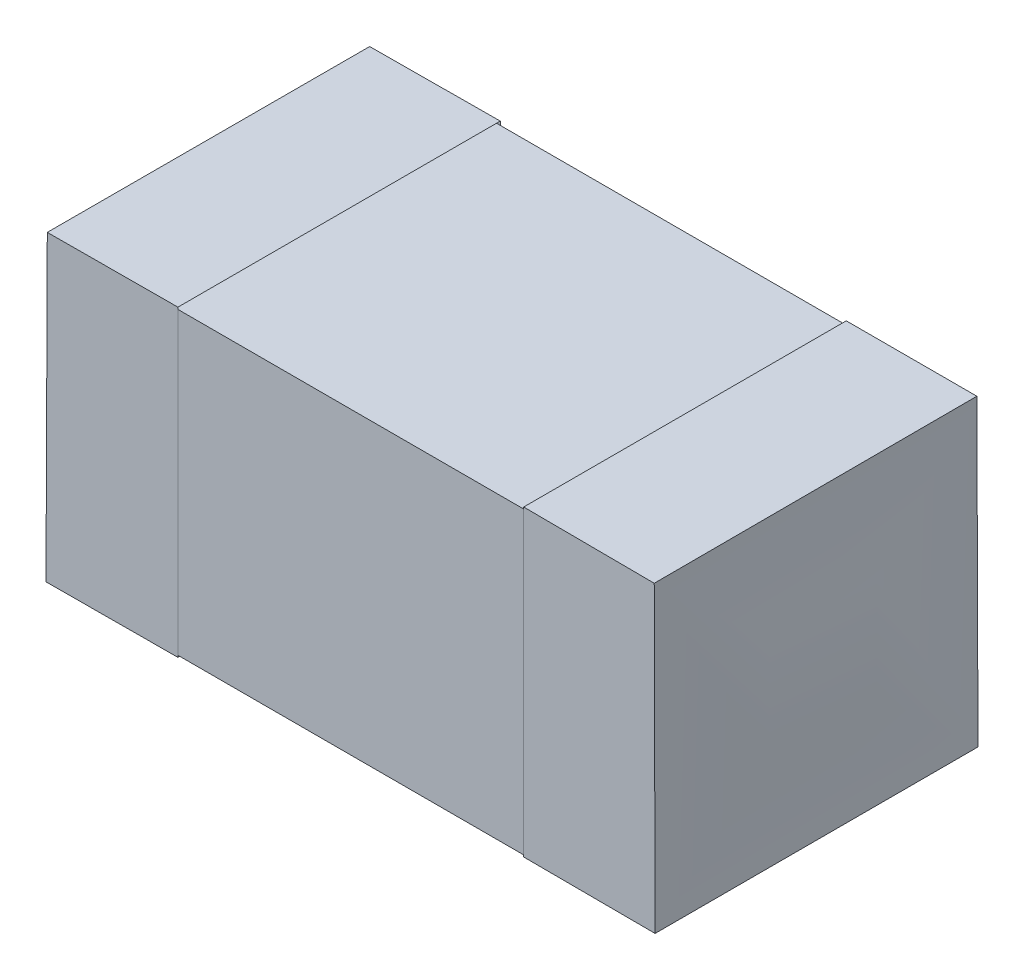
ISO-10303-21;
HEADER;
FILE_DESCRIPTION(('STEP AP214'),'2;1');
FILE_NAME('part.step','',(''),(''),'','','');
FILE_SCHEMA(('AUTOMOTIVE_DESIGN { 1 0 10303 214 1 1 1 1 }'));
ENDSEC;
DATA;
#1=APPLICATION_CONTEXT('core data for automotive mechanical design processes');
#2=APPLICATION_PROTOCOL_DEFINITION('international standard','automotive_design',2000,#1);
#3=PRODUCT_CONTEXT('',#1,'mechanical');
#4=PRODUCT('Part','Part','',(#3));
#5=PRODUCT_RELATED_PRODUCT_CATEGORY('part','',(#4));
#6=PRODUCT_DEFINITION_FORMATION('','',#4);
#7=PRODUCT_DEFINITION_CONTEXT('part definition',#1,'design');
#8=PRODUCT_DEFINITION('design','',#6,#7);
#9=PRODUCT_DEFINITION_SHAPE('','',#8);
#10=(LENGTH_UNIT() NAMED_UNIT(*) SI_UNIT(.MILLI.,.METRE.));
#11=(NAMED_UNIT(*) PLANE_ANGLE_UNIT() SI_UNIT($,.RADIAN.));
#12=(NAMED_UNIT(*) SI_UNIT($,.STERADIAN.) SOLID_ANGLE_UNIT());
#13=UNCERTAINTY_MEASURE_WITH_UNIT(LENGTH_MEASURE(1.E-05),#10,'distance_accuracy_value','');
#14=(GEOMETRIC_REPRESENTATION_CONTEXT(3) GLOBAL_UNCERTAINTY_ASSIGNED_CONTEXT((#13)) GLOBAL_UNIT_ASSIGNED_CONTEXT((#10,
#11,#12)) REPRESENTATION_CONTEXT('',''));
#15=CARTESIAN_POINT('',(0.,0.,0.));
#16=DIRECTION('',(0.,0.,1.));
#17=DIRECTION('',(1.,0.,0.));
#18=AXIS2_PLACEMENT_3D('',#15,#16,#17);
#19=CARTESIAN_POINT('',(-500000.,-0.395000000000003,0.844999999999999));
#20=DIRECTION('',(0.,-1.,0.));
#21=DIRECTION('',(0.,0.,-1.));
#22=AXIS2_PLACEMENT_3D('',#19,#20,#21);
#23=PLANE('',#22);
#24=DIRECTION('',(1.,0.,0.));
#25=VECTOR('',#24,1.);
#26=CARTESIAN_POINT('',(-500000.,-0.395000000000003,0.844999999999999));
#27=LINE('',#26,#25);
#28=CARTESIAN_POINT('',(-0.795000000043597,-0.395000000000003,0.844999999999999));
#29=VERTEX_POINT('',#28);
#30=CARTESIAN_POINT('',(0.795000000043597,-0.395000000000002,0.844999999999999));
#31=VERTEX_POINT('',#30);
#32=EDGE_CURVE('P0_E55',#29,#31,#27,.T.);
#33=ORIENTED_EDGE('',*,*,#32,.F.);
#34=DIRECTION('',(0.,0.,-1.));
#35=VECTOR('',#34,1.);
#36=CARTESIAN_POINT('',(-0.795,-0.395000000000003,0.));
#37=LINE('',#36,#35);
#38=CARTESIAN_POINT('',(-0.795000000029386,-0.395000000000001,0.00499999999999861));
#39=VERTEX_POINT('',#38);
#40=EDGE_CURVE('P0_E57',#29,#39,#37,.T.);
#41=ORIENTED_EDGE('',*,*,#40,.T.);
#42=DIRECTION('',(1.,0.,0.));
#43=VECTOR('',#42,1.);
#44=CARTESIAN_POINT('',(-500000.,-0.395,0.00499999999999862));
#45=LINE('',#44,#43);
#46=CARTESIAN_POINT('',(0.795000000029386,-0.395,0.0049999999999993));
#47=VERTEX_POINT('',#46);
#48=EDGE_CURVE('P0_E20',#47,#39,#45,.F.);
#49=ORIENTED_EDGE('',*,*,#48,.F.);
#50=DIRECTION('',(0.,0.,1.));
#51=VECTOR('',#50,1.);
#52=CARTESIAN_POINT('',(0.795,-0.395,0.));
#53=LINE('',#52,#51);
#54=EDGE_CURVE('P0_E80',#47,#31,#53,.T.);
#55=ORIENTED_EDGE('',*,*,#54,.T.);
#56=EDGE_LOOP('',(#33,#41,#49,#55));
#57=FACE_BOUND('',#56,.T.);
#58=ADVANCED_FACE('P0_F17',(#57),#23,.T.);
#59=CARTESIAN_POINT('',(-500000.,-0.395,0.00499999999999862));
#60=DIRECTION('',(0.,0.,-1.));
#61=DIRECTION('',(0.,1.,0.));
#62=AXIS2_PLACEMENT_3D('',#59,#60,#61);
#63=PLANE('',#62);
#64=ORIENTED_EDGE('',*,*,#48,.T.);
#65=DIRECTION('',(0.,1.,0.));
#66=VECTOR('',#65,1.);
#67=CARTESIAN_POINT('',(-0.795,0.,0.00499999999999862));
#68=LINE('',#67,#66);
#69=CARTESIAN_POINT('',(-0.795000000043597,0.39,0.00500000000000068));
#70=VERTEX_POINT('',#69);
#71=EDGE_CURVE('P0_E63',#39,#70,#68,.T.);
#72=ORIENTED_EDGE('',*,*,#71,.T.);
#73=DIRECTION('',(1.,0.,0.));
#74=VECTOR('',#73,1.);
#75=CARTESIAN_POINT('',(-500000.,0.39,0.00500000000000136));
#76=LINE('',#75,#74);
#77=CARTESIAN_POINT('',(0.795000000029386,0.389999999999999,0.00500000000000136));
#78=VERTEX_POINT('',#77);
#79=EDGE_CURVE('P0_E83',#78,#70,#76,.F.);
#80=ORIENTED_EDGE('',*,*,#79,.F.);
#81=DIRECTION('',(0.,1.,0.));
#82=VECTOR('',#81,1.);
#83=CARTESIAN_POINT('',(0.795,0.,0.00500000000000136));
#84=LINE('',#83,#82);
#85=EDGE_CURVE('P0_E68',#78,#47,#84,.F.);
#86=ORIENTED_EDGE('',*,*,#85,.T.);
#87=EDGE_LOOP('',(#64,#72,#80,#86));
#88=FACE_BOUND('',#87,.T.);
#89=ADVANCED_FACE('P0_F65',(#88),#63,.T.);
#90=CARTESIAN_POINT('',(-0.795,0.,0.));
#91=DIRECTION('',(1.,0.,0.));
#92=DIRECTION('',(0.,0.,-1.));
#93=AXIS2_PLACEMENT_3D('',#90,#91,#92);
#94=PLANE('',#93);
#95=DIRECTION('',(0.,0.,1.));
#96=VECTOR('',#95,1.);
#97=CARTESIAN_POINT('',(-0.795000000096024,0.39,0.00500000000000136));
#98=LINE('',#97,#96);
#99=CARTESIAN_POINT('',(-0.795000000048012,0.389999999999999,0.845000000000001));
#100=VERTEX_POINT('',#99);
#101=EDGE_CURVE('P0_E72',#70,#100,#98,.T.);
#102=ORIENTED_EDGE('',*,*,#101,.F.);
#103=ORIENTED_EDGE('',*,*,#71,.F.);
#104=ORIENTED_EDGE('',*,*,#40,.F.);
#105=DIRECTION('',(0.,-1.,0.));
#106=VECTOR('',#105,1.);
#107=CARTESIAN_POINT('',(-0.795000000096024,0.389999999999997,0.845000000000001));
#108=LINE('',#107,#106);
#109=EDGE_CURVE('P0_E75',#100,#29,#108,.T.);
#110=ORIENTED_EDGE('',*,*,#109,.F.);
#111=EDGE_LOOP('',(#102,#103,#104,#110));
#112=FACE_BOUND('',#111,.T.);
#113=ADVANCED_FACE('P0_F70',(#112),#94,.F.);
#114=CARTESIAN_POINT('',(-500000.,0.389999999999997,0.845000000000001));
#115=DIRECTION('',(0.,0.,1.));
#116=DIRECTION('',(0.,-1.,0.));
#117=AXIS2_PLACEMENT_3D('',#114,#115,#116);
#118=PLANE('',#117);
#119=DIRECTION('',(1.,0.,0.));
#120=VECTOR('',#119,1.);
#121=CARTESIAN_POINT('',(-500000.,0.389999999999997,0.845000000000001));
#122=LINE('',#121,#120);
#123=CARTESIAN_POINT('',(0.795000000057807,0.389999999999997,0.845000000000001));
#124=VERTEX_POINT('',#123);
#125=EDGE_CURVE('P0_E26',#100,#124,#122,.T.);
#126=ORIENTED_EDGE('',*,*,#125,.F.);
#127=ORIENTED_EDGE('',*,*,#109,.T.);
#128=ORIENTED_EDGE('',*,*,#32,.T.);
#129=DIRECTION('',(0.,1.,0.));
#130=VECTOR('',#129,1.);
#131=CARTESIAN_POINT('',(0.795,0.,0.844999999999999));
#132=LINE('',#131,#130);
#133=EDGE_CURVE('P0_E35',#31,#124,#132,.T.);
#134=ORIENTED_EDGE('',*,*,#133,.T.);
#135=EDGE_LOOP('',(#126,#127,#128,#134));
#136=FACE_BOUND('',#135,.T.);
#137=ADVANCED_FACE('P0_F89',(#136),#118,.T.);
#138=CARTESIAN_POINT('',(0.795,0.,0.));
#139=DIRECTION('',(-1.,0.,0.));
#140=DIRECTION('',(0.,0.,1.));
#141=AXIS2_PLACEMENT_3D('',#138,#139,#140);
#142=PLANE('',#141);
#143=ORIENTED_EDGE('',*,*,#54,.F.);
#144=ORIENTED_EDGE('',*,*,#85,.F.);
#145=DIRECTION('',(0.,0.,1.));
#146=VECTOR('',#145,1.);
#147=CARTESIAN_POINT('',(0.795000000039181,0.39,0.00500000000000136));
#148=LINE('',#147,#146);
#149=EDGE_CURVE('P0_E11',#124,#78,#148,.F.);
#150=ORIENTED_EDGE('',*,*,#149,.F.);
#151=ORIENTED_EDGE('',*,*,#133,.F.);
#152=EDGE_LOOP('',(#143,#144,#150,#151));
#153=FACE_BOUND('',#152,.T.);
#154=ADVANCED_FACE('P0_F91',(#153),#142,.F.);
#155=CARTESIAN_POINT('',(-500000.,0.39,0.00500000000000136));
#156=DIRECTION('',(0.,1.,0.));
#157=DIRECTION('',(0.,0.,1.));
#158=AXIS2_PLACEMENT_3D('',#155,#156,#157);
#159=PLANE('',#158);
#160=ORIENTED_EDGE('',*,*,#125,.T.);
#161=ORIENTED_EDGE('',*,*,#149,.T.);
#162=ORIENTED_EDGE('',*,*,#79,.T.);
#163=ORIENTED_EDGE('',*,*,#101,.T.);
#164=EDGE_LOOP('',(#160,#161,#162,#163));
#165=FACE_BOUND('',#164,.T.);
#166=ADVANCED_FACE('P0_F88',(#165),#159,.T.);
#167=CLOSED_SHELL('',(#58,#89,#113,#137,#154,#166));
#168=MANIFOLD_SOLID_BREP('P0_B1',#167);
#169=CARTESIAN_POINT('',(0.45,-0.400000000000003,0.849999999999999));
#170=DIRECTION('',(0.,1.,0.));
#171=DIRECTION('',(0.,0.,1.));
#172=AXIS2_PLACEMENT_3D('',#169,#170,#171);
#173=PLANE('',#172);
#174=CARTESIAN_POINT('',(0.800005390803355,-0.396601740628309,0.846601050125399));
#175=CARTESIAN_POINT('',(0.800061863844547,-0.396402970394217,0.81146620669896));
#176=CARTESIAN_POINT('',(0.800119763269419,-0.396229046363452,0.776331223138376));
#177=CARTESIAN_POINT('',(0.800228561587458,-0.39593089639933,0.706061686690878));
#178=CARTESIAN_POINT('',(0.800279460610521,-0.395806669543734,0.670927133808071));
#179=CARTESIAN_POINT('',(0.800364406939909,-0.395607913912051,0.600658455691831));
#180=CARTESIAN_POINT('',(0.800398454529254,-0.395533384301293,0.565524330461126));
#181=CARTESIAN_POINT('',(0.800444475109149,-0.395434023054447,0.495256509280837));
#182=CARTESIAN_POINT('',(0.800456448423063,-0.395409190690351,0.460122813332505));
#183=CARTESIAN_POINT('',(0.800456441279877,-0.395409223829555,0.389855852112512));
#184=CARTESIAN_POINT('',(0.800444461116389,-0.395434088723688,0.354722586840852));
#185=CARTESIAN_POINT('',(0.800398429176325,-0.395533516248937,0.284456488369492));
#186=CARTESIAN_POINT('',(0.800364377617507,-0.395608078389736,0.24932365516895));
#187=CARTESIAN_POINT('',(0.800279428231888,-0.395806900299839,0.17905842246882));
#188=CARTESIAN_POINT('',(0.800228530535126,-0.395931159685518,0.143926022967978));
#189=CARTESIAN_POINT('',(0.800119741596699,-0.396229375928021,0.0736616546450172));
#190=CARTESIAN_POINT('',(0.800061850396687,-0.396403332488843,0.0385296858215803));
#191=CARTESIAN_POINT('',(0.800005388449318,-0.396602138298579,0.00339785717515824));
#192=B_SPLINE_CURVE_WITH_KNOTS('',3,(#174,#175,#176,#177,#178,#179,#180,#181,#182,#183,#184,
#185,#186,#187,#188,#189,#190,#191),.UNSPECIFIED.,.F.,.F.,(4,2,2,2,2,2,2,2,4),(0.,
0.105406347759802,0.210810739386303,0.316213360691081,0.421614437956563,0.527014223267688,
0.632412968709574,0.73781090056985,0.843208204682941),.UNSPECIFIED.);
#193=CARTESIAN_POINT('',(0.798024687185298,-0.397992312054801,0.84812708880466));
#194=VERTEX_POINT('',#193);
#195=CARTESIAN_POINT('',(0.797956275462862,-0.397843835611499,0.00183139232658597));
#196=VERTEX_POINT('',#195);
#197=EDGE_CURVE('P1_E67',#194,#196,#192,.T.);
#198=ORIENTED_EDGE('',*,*,#197,.F.);
#199=CARTESIAN_POINT('',(0.796824986781816,-0.400000000000003,0.849999999999999));
#200=DIRECTION('',(-1.,0.,0.));
#201=VECTOR('',#200,1.);
#202=LINE('',#199,#201);
#203=CARTESIAN_POINT('',(0.453132754421605,-0.397287046605125,0.847496139950693));
#204=VERTEX_POINT('',#203);
#205=EDGE_CURVE('P1_E90',#194,#204,#202,.T.);
#206=ORIENTED_EDGE('',*,*,#205,.T.);
#207=CARTESIAN_POINT('',(0.453485225218303,-0.395,0.00424277090797743));
#208=DIRECTION('',(-0.000418450537538887,0.,0.99999991244957));
#209=VECTOR('',#208,1.);
#210=LINE('',#207,#209);
#211=CARTESIAN_POINT('',(0.453485463855357,-0.397299738041328,0.00260079185780102));
#212=VERTEX_POINT('',#211);
#213=EDGE_CURVE('P1_E85',#212,#204,#210,.T.);
#214=ORIENTED_EDGE('',*,*,#213,.F.);
#215=CARTESIAN_POINT('',(0.453485542081141,-0.4,0.));
#216=DIRECTION('',(1.,0.,0.));
#217=VECTOR('',#216,1.);
#218=LINE('',#215,#217);
#219=EDGE_CURVE('P1_E82',#212,#196,#218,.T.);
#220=ORIENTED_EDGE('',*,*,#219,.T.);
#221=EDGE_LOOP('',(#198,#206,#214,#220));
#222=FACE_BOUND('',#221,.T.);
#223=ADVANCED_FACE('P1_F17',(#222),#173,.F.);
#224=CARTESIAN_POINT('',(0.45,-0.400000000000003,0.849999999999999));
#225=DIRECTION('',(0.,0.,-1.));
#226=DIRECTION('',(0.,1.,0.));
#227=AXIS2_PLACEMENT_3D('',#224,#225,#226);
#228=PLANE('',#227);
#229=CARTESIAN_POINT('',(0.800022980597674,0.390011404175279,0.845020057270689));
#230=CARTESIAN_POINT('',(0.800097131491583,0.357235879745679,0.845085931926198));
#231=CARTESIAN_POINT('',(0.800158959234675,0.324460329131634,0.845151806634334));
#232=CARTESIAN_POINT('',(0.800260188326595,0.258909227903517,0.845283556050606));
#233=CARTESIAN_POINT('',(0.800299589699292,0.226133677289481,0.845349430758742));
#234=CARTESIAN_POINT('',(0.800358186089844,0.160582576949562,0.845481180173229));
#235=CARTESIAN_POINT('',(0.800377381118974,0.127807027223688,0.845547054879581));
#236=CARTESIAN_POINT('',(0.800397787529158,0.0622559283258053,0.845678804291169));
#237=CARTESIAN_POINT('',(0.800398998913396,0.0294803791537973,0.845744678996407));
#238=CARTESIAN_POINT('',(0.800385662660879,-0.0360707186345306,0.845876428405766));
#239=CARTESIAN_POINT('',(0.800371115022669,-0.0688462672508501,0.845942303109887));
#240=CARTESIAN_POINT('',(0.800328487521277,-0.134397364049465,0.846074052517257));
#241=CARTESIAN_POINT('',(0.800300407654526,-0.167172912231758,0.846139927220505));
#242=CARTESIAN_POINT('',(0.800232944419666,-0.232724008127607,0.84627167662606));
#243=CARTESIAN_POINT('',(0.800193561047589,-0.265499555841158,0.846337551328367));
#244=CARTESIAN_POINT('',(0.800105722175429,-0.331050651268265,0.84646930073298));
#245=CARTESIAN_POINT('',(0.800057266672009,-0.363826198981816,0.846535175435286));
#246=CARTESIAN_POINT('',(0.800005390803355,-0.396601740628309,0.846601050125399));
#247=B_SPLINE_CURVE_WITH_KNOTS('',3,(#229,#230,#231,#232,#233,#234,#235,#236,#237,#238,#239,
#240,#241,#242,#243,#244,#245,#246),.UNSPECIFIED.,.F.,.F.,(4,2,2,2,2,2,2,2,4),(0.,
0.0983270187472221,0.196653932837637,0.294980792057082,0.393307633871612,0.491634484769268,
0.589961361606147,0.688288272956738,0.786615220468539),.UNSPECIFIED.);
#248=CARTESIAN_POINT('',(0.795388503939549,0.3952986078463,0.847712562210093));
#249=VERTEX_POINT('',#248);
#250=EDGE_CURVE('P1_E74',#249,#194,#247,.T.);
#251=ORIENTED_EDGE('',*,*,#250,.F.);
#252=CARTESIAN_POINT('',(0.453132754421605,0.399999999999997,0.850000000000001));
#253=DIRECTION('',(1.,0.,0.));
#254=VECTOR('',#253,1.);
#255=LINE('',#252,#254);
#256=CARTESIAN_POINT('',(0.453132754938995,0.397199993506258,0.847596776669852));
#257=VERTEX_POINT('',#256);
#258=EDGE_CURVE('P1_E78',#257,#249,#255,.T.);
#259=ORIENTED_EDGE('',*,*,#258,.F.);
#260=CARTESIAN_POINT('',(0.453132754421605,-0.396566377228811,0.844999999999999));
#261=DIRECTION('',(0.,1.,0.));
#262=VECTOR('',#261,1.);
#263=LINE('',#260,#262);
#264=EDGE_CURVE('P1_E177',#204,#257,#263,.T.);
#265=ORIENTED_EDGE('',*,*,#264,.F.);
#266=ORIENTED_EDGE('',*,*,#205,.F.);
#267=EDGE_LOOP('',(#251,#259,#265,#266));
#268=FACE_BOUND('',#267,.T.);
#269=ADVANCED_FACE('P1_F111',(#268),#228,.F.);
#270=CARTESIAN_POINT('',(0.45,-0.4,0.));
#271=DIRECTION('',(0.,0.,1.));
#272=DIRECTION('',(0.,-1.,0.));
#273=AXIS2_PLACEMENT_3D('',#270,#271,#272);
#274=PLANE('',#273);
#275=CARTESIAN_POINT('',(0.789979573071092,0.4,0.));
#276=DIRECTION('',(-1.,0.,0.));
#277=VECTOR('',#276,1.);
#278=LINE('',#275,#277);
#279=CARTESIAN_POINT('',(0.795181071417052,0.396860718061131,0.00202683753674809));
#280=VERTEX_POINT('',#279);
#281=CARTESIAN_POINT('',(0.453210911635254,0.397170668848791,0.00235296497214367));
#282=VERTEX_POINT('',#281);
#283=EDGE_CURVE('P1_E40',#280,#282,#278,.T.);
#284=ORIENTED_EDGE('',*,*,#283,.F.);
#285=CARTESIAN_POINT('',(0.800005388449318,-0.396602138298579,0.00339785717515824));
#286=CARTESIAN_POINT('',(0.800057906157028,-0.363410388758925,0.00346445104431971));
#287=CARTESIAN_POINT('',(0.800106912772915,-0.330218632975666,0.00353104492600796));
#288=CARTESIAN_POINT('',(0.800195590433512,-0.263835121409144,0.00366423268938448));
#289=CARTESIAN_POINT('',(0.8002352614817,-0.230643365625885,0.00373082657107273));
#290=CARTESIAN_POINT('',(0.800302954649959,-0.164259853564965,0.00386401433544117));
#291=CARTESIAN_POINT('',(0.800330976774152,-0.131068097287308,0.00393060821812135));
#292=CARTESIAN_POINT('',(0.800373061516785,-0.0646845842735967,0.00406379598440141));
#293=CARTESIAN_POINT('',(0.800387124138879,-0.0314928275375457,0.00413038986800128));
#294=CARTESIAN_POINT('',(0.800398981323559,0.0348906865217858,0.00426357763637921));
#295=CARTESIAN_POINT('',(0.800396775887476,0.0680824438450659,0.00433017152115727));
#296=CARTESIAN_POINT('',(0.800373790680656,0.134465959077198,0.00446335929188823));
#297=CARTESIAN_POINT('',(0.8003530109062,0.167657716986049,0.00452995317784114));
#298=CARTESIAN_POINT('',(0.800290572767253,0.234041233743261,0.00466314095163193));
#299=CARTESIAN_POINT('',(0.800248914390258,0.26723299259161,0.00472973483946979));
#300=CARTESIAN_POINT('',(0.800142417596725,0.333616510288361,0.00486292261514561));
#301=CARTESIAN_POINT('',(0.80007757915403,0.366808269136721,0.00492951650298349));
#302=CARTESIAN_POINT('',(0.8,0.4,0.00499611033467384));
#303=B_SPLINE_CURVE_WITH_KNOTS('',3,(#285,#286,#287,#288,#289,#290,#291,#292,#293,#294,#295,
#296,#297,#298,#299,#300,#301,#302),.UNSPECIFIED.,.F.,.F.,(4,2,2,2,2,2,2,2,4),(0.,
0.0995755745356732,0.199151111984349,0.298726614203991,0.398302090360534,0.497877558365518,
0.597453046309139,0.697028593888706,0.796604253832489),.UNSPECIFIED.);
#304=EDGE_CURVE('P1_E71',#196,#280,#303,.T.);
#305=ORIENTED_EDGE('',*,*,#304,.F.);
#306=ORIENTED_EDGE('',*,*,#219,.F.);
#307=CARTESIAN_POINT('',(0.453210911635254,0.396421823247295,0.00500000000000138));
#308=DIRECTION('',(0.00034634615156126,-0.99999994002217,0.));
#309=VECTOR('',#308,1.);
#310=LINE('',#307,#309);
#311=EDGE_CURVE('P1_E301',#282,#212,#310,.T.);
#312=ORIENTED_EDGE('',*,*,#311,.F.);
#313=EDGE_LOOP('',(#284,#305,#306,#312));
#314=FACE_BOUND('',#313,.T.);
#315=ADVANCED_FACE('P1_F94',(#314),#274,.F.);
#316=CARTESIAN_POINT('',(0.45,-0.395000000000003,0.849999999999999));
#317=DIRECTION('',(0.,1.,0.));
#318=DIRECTION('',(0.,0.,1.));
#319=AXIS2_PLACEMENT_3D('',#316,#317,#318);
#320=PLANE('',#319);
#321=ORIENTED_EDGE('',*,*,#213,.T.);
#322=CARTESIAN_POINT('',(0.795,-0.395000000000003,0.844999999999999));
#323=DIRECTION('',(-0.999989503587189,-0.00458178081616285,0.));
#324=VECTOR('',#323,1.);
#325=LINE('',#322,#324);
#326=CARTESIAN_POINT('',(0.795,-0.395000000000002,0.844999999999999));
#327=VERTEX_POINT('',#326);
#328=EDGE_CURVE('P1_E192',#327,#204,#325,.T.);
#329=ORIENTED_EDGE('',*,*,#328,.F.);
#330=DIRECTION('',(0.,0.,1.));
#331=VECTOR('',#330,1.);
#332=CARTESIAN_POINT('',(0.795,-0.395,0.));
#333=LINE('',#332,#331);
#334=CARTESIAN_POINT('',(0.795,-0.395,0.00499999999999862));
#335=VERTEX_POINT('',#334);
#336=EDGE_CURVE('P1_E330',#335,#327,#333,.T.);
#337=ORIENTED_EDGE('',*,*,#336,.F.);
#338=CARTESIAN_POINT('',(0.453485542081141,-0.39651445791886,0.00499999999999861));
#339=DIRECTION('',(0.999990167593356,0.00443449169713676,0.));
#340=VECTOR('',#339,1.);
#341=LINE('',#338,#340);
#342=EDGE_CURVE('P1_E292',#212,#335,#341,.T.);
#343=ORIENTED_EDGE('',*,*,#342,.F.);
#344=EDGE_LOOP('',(#321,#329,#337,#343));
#345=FACE_BOUND('',#344,.T.);
#346=ADVANCED_FACE('P1_F110',(#345),#320,.T.);
#347=CARTESIAN_POINT('',(0.795,0.,0.));
#348=DIRECTION('',(-1.,0.,0.));
#349=DIRECTION('',(0.,0.,1.));
#350=AXIS2_PLACEMENT_3D('',#347,#348,#349);
#351=PLANE('',#350);
#352=DIRECTION('',(0.,1.,0.));
#353=VECTOR('',#352,1.);
#354=CARTESIAN_POINT('',(0.795,-0.400000000000003,0.844999999999999));
#355=LINE('',#354,#353);
#356=CARTESIAN_POINT('',(0.795,0.389999999999997,0.845000000000001));
#357=VERTEX_POINT('',#356);
#358=EDGE_CURVE('P1_E194',#357,#327,#355,.F.);
#359=ORIENTED_EDGE('',*,*,#358,.F.);
#360=DIRECTION('',(0.,0.,-1.));
#361=VECTOR('',#360,1.);
#362=CARTESIAN_POINT('',(0.795,0.39,0.));
#363=LINE('',#362,#361);
#364=CARTESIAN_POINT('',(0.795,0.39,0.00500000000000136));
#365=VERTEX_POINT('',#364);
#366=EDGE_CURVE('P1_E328',#357,#365,#363,.T.);
#367=ORIENTED_EDGE('',*,*,#366,.T.);
#368=DIRECTION('',(0.,-1.,0.));
#369=VECTOR('',#368,1.);
#370=CARTESIAN_POINT('',(0.795,-0.4,0.0049999999999986));
#371=LINE('',#370,#369);
#372=EDGE_CURVE('P1_E309',#335,#365,#371,.F.);
#373=ORIENTED_EDGE('',*,*,#372,.F.);
#374=ORIENTED_EDGE('',*,*,#336,.T.);
#375=EDGE_LOOP('',(#359,#367,#373,#374));
#376=FACE_BOUND('',#375,.T.);
#377=ADVANCED_FACE('P1_F325',(#376),#351,.T.);
#378=CARTESIAN_POINT('',(0.45,-0.400000000000003,0.844999999999999));
#379=DIRECTION('',(0.,0.,-1.));
#380=DIRECTION('',(0.,1.,0.));
#381=AXIS2_PLACEMENT_3D('',#378,#379,#380);
#382=PLANE('',#381);
#383=CARTESIAN_POINT('',(0.79,0.394999999999997,0.845000000000001));
#384=CARTESIAN_POINT('',(0.794420948509997,0.394420948509994,0.845000000000001));
#385=CARTESIAN_POINT('',(0.795,0.389999999999997,0.845000000000001));
#386=B_SPLINE_CURVE_WITH_KNOTS('',2,(#383,#384,#385),.UNSPECIFIED.,.F.,.F.,(3,3),(0.,1.),.UNSPECIFIED.);
#387=CARTESIAN_POINT('',(0.79,0.394999999999997,0.845000000000001));
#388=VERTEX_POINT('',#387);
#389=EDGE_CURVE('P1_E205',#388,#357,#386,.T.);
#390=ORIENTED_EDGE('',*,*,#389,.T.);
#391=ORIENTED_EDGE('',*,*,#358,.T.);
#392=ORIENTED_EDGE('',*,*,#328,.T.);
#393=ORIENTED_EDGE('',*,*,#264,.T.);
#394=CARTESIAN_POINT('',(0.79,0.394999999999997,0.845000000000001));
#395=DIRECTION('',(-0.999989189730279,0.,0.00464977661609556));
#396=VECTOR('',#395,1.);
#397=LINE('',#394,#396);
#398=EDGE_CURVE('P1_E187',#388,#257,#397,.T.);
#399=ORIENTED_EDGE('',*,*,#398,.F.);
#400=EDGE_LOOP('',(#390,#391,#392,#393,#399));
#401=FACE_BOUND('',#400,.T.);
#402=ADVANCED_FACE('P1_F185',(#401),#382,.T.);
#403=CARTESIAN_POINT('',(0.45,-0.4,0.0049999999999986));
#404=DIRECTION('',(0.,0.,1.));
#405=DIRECTION('',(0.,-1.,0.));
#406=AXIS2_PLACEMENT_3D('',#403,#404,#405);
#407=PLANE('',#406);
#408=CARTESIAN_POINT('',(0.795,0.39,0.00500000000000136));
#409=CARTESIAN_POINT('',(0.794420948509997,0.394420948509997,0.00500000000000138));
#410=CARTESIAN_POINT('',(0.79,0.395,0.00500000000000138));
#411=B_SPLINE_CURVE_WITH_KNOTS('',2,(#408,#409,#410),.UNSPECIFIED.,.F.,.F.,(3,3),(0.,1.),.UNSPECIFIED.);
#412=CARTESIAN_POINT('',(0.79,0.395,0.0050000000000014));
#413=VERTEX_POINT('',#412);
#414=EDGE_CURVE('P1_E336',#365,#413,#411,.T.);
#415=ORIENTED_EDGE('',*,*,#414,.T.);
#416=CARTESIAN_POINT('',(0.453210911635254,0.395,0.00321091162837751));
#417=DIRECTION('',(0.99998589060558,0.,0.00531211725818398));
#418=VECTOR('',#417,1.);
#419=LINE('',#416,#418);
#420=EDGE_CURVE('P1_E204',#282,#413,#419,.T.);
#421=ORIENTED_EDGE('',*,*,#420,.F.);
#422=ORIENTED_EDGE('',*,*,#311,.T.);
#423=ORIENTED_EDGE('',*,*,#342,.T.);
#424=ORIENTED_EDGE('',*,*,#372,.T.);
#425=EDGE_LOOP('',(#415,#421,#422,#423,#424));
#426=FACE_BOUND('',#425,.T.);
#427=ADVANCED_FACE('P1_F258',(#426),#407,.T.);
#428=CARTESIAN_POINT('',(0.79,0.39,0.));
#429=DIRECTION('',(0.,0.,-1.));
#430=DIRECTION('',(0.,1.,0.));
#431=AXIS2_PLACEMENT_3D('',#428,#429,#430);
#432=CYLINDRICAL_SURFACE('',#431,0.00500000000000001);
#433=DIRECTION('',(0.,0.,-1.));
#434=VECTOR('',#433,1.);
#435=CARTESIAN_POINT('',(0.79,0.394999999999997,0.850000000000001));
#436=LINE('',#435,#434);
#437=EDGE_CURVE('P1_E203',#413,#388,#436,.F.);
#438=ORIENTED_EDGE('',*,*,#437,.F.);
#439=ORIENTED_EDGE('',*,*,#414,.F.);
#440=ORIENTED_EDGE('',*,*,#366,.F.);
#441=ORIENTED_EDGE('',*,*,#389,.F.);
#442=EDGE_LOOP('',(#438,#439,#440,#441));
#443=FACE_BOUND('',#442,.T.);
#444=ADVANCED_FACE('P1_F267',(#443),#432,.F.);
#445=CARTESIAN_POINT('',(0.45,0.394999999999997,0.850000000000001));
#446=DIRECTION('',(0.,-1.,0.));
#447=DIRECTION('',(0.,0.,-1.));
#448=AXIS2_PLACEMENT_3D('',#445,#446,#447);
#449=PLANE('',#448);
#450=ORIENTED_EDGE('',*,*,#420,.T.);
#451=ORIENTED_EDGE('',*,*,#437,.T.);
#452=ORIENTED_EDGE('',*,*,#398,.T.);
#453=CARTESIAN_POINT('',(0.453132755515229,0.394999999999997,0.846566374369065));
#454=DIRECTION('',(9.26728089660547E-05,0.,-0.999999995705875));
#455=VECTOR('',#454,1.);
#456=LINE('',#453,#455);
#457=EDGE_CURVE('P1_E31',#257,#282,#456,.T.);
#458=ORIENTED_EDGE('',*,*,#457,.T.);
#459=EDGE_LOOP('',(#450,#451,#452,#458));
#460=FACE_BOUND('',#459,.T.);
#461=ADVANCED_FACE('P1_F145',(#460),#449,.T.);
#462=CARTESIAN_POINT('',(0.45,0.399999999999997,0.850000000000001));
#463=DIRECTION('',(0.,-1.,0.));
#464=DIRECTION('',(0.,0.,-1.));
#465=AXIS2_PLACEMENT_3D('',#462,#463,#464);
#466=PLANE('',#465);
#467=ORIENTED_EDGE('',*,*,#283,.T.);
#468=ORIENTED_EDGE('',*,*,#457,.F.);
#469=ORIENTED_EDGE('',*,*,#258,.T.);
#470=DIRECTION('',(0.,0.,1.));
#471=VECTOR('',#470,1.);
#472=CARTESIAN_POINT('',(0.8,0.399999999999999,0.425000000000001));
#473=LINE('',#472,#471);
#474=EDGE_CURVE('P1_E11',#280,#249,#473,.T.);
#475=ORIENTED_EDGE('',*,*,#474,.F.);
#476=EDGE_LOOP('',(#467,#468,#469,#475));
#477=FACE_BOUND('',#476,.T.);
#478=ADVANCED_FACE('P1_F136',(#477),#466,.F.);
#479=CARTESIAN_POINT('',(0.8,0.4,0.));
#480=CARTESIAN_POINT('',(0.8,0.133333333333333,0.));
#481=CARTESIAN_POINT('',(0.8,-0.133333333333333,0.));
#482=CARTESIAN_POINT('',(0.8,-0.4,0.));
#483=CARTESIAN_POINT('',(0.8,0.399999999999999,0.283333333333335));
#484=CARTESIAN_POINT('',(0.835555555555555,0.133333333333332,0.283333333333334));
#485=CARTESIAN_POINT('',(0.835555555555555,-0.133333333333334,0.283333333333333));
#486=CARTESIAN_POINT('',(0.8,-0.400000000000001,0.283333333333332));
#487=CARTESIAN_POINT('',(0.8,0.399999999999998,0.566666666666668));
#488=CARTESIAN_POINT('',(0.835555555555555,0.133333333333331,0.566666666666667));
#489=CARTESIAN_POINT('',(0.835555555555555,-0.133333333333335,0.566666666666666));
#490=CARTESIAN_POINT('',(0.8,-0.400000000000002,0.566666666666665));
#491=CARTESIAN_POINT('',(0.8,0.399999999999997,0.850000000000001));
#492=CARTESIAN_POINT('',(0.8,0.13333333333333,0.85));
#493=CARTESIAN_POINT('',(0.8,-0.133333333333336,0.849999999999999));
#494=CARTESIAN_POINT('',(0.8,-0.400000000000003,0.849999999999999));
#495=B_SPLINE_SURFACE_WITH_KNOTS('',3,3,((#479,#480,#481,#482),(#483,#484,#485,#486),(#487,#488,
#489,#490),(#491,#492,#493,#494)),.UNSPECIFIED.,.F.,.F.,.F.,(4,4),(4,4),(0.,1.),(0.,1.),.UNSPECIFIED.);
#496=ORIENTED_EDGE('',*,*,#197,.T.);
#497=ORIENTED_EDGE('',*,*,#304,.T.);
#498=ORIENTED_EDGE('',*,*,#474,.T.);
#499=ORIENTED_EDGE('',*,*,#250,.T.);
#500=EDGE_LOOP('',(#496,#497,#498,#499));
#501=FACE_BOUND('',#500,.T.);
#502=ADVANCED_FACE('P1_F19',(#501),#495,.T.);
#503=CLOSED_SHELL('',(#223,#269,#315,#346,#377,#402,#427,#444,#461,#478,#502));
#504=MANIFOLD_SOLID_BREP('P1_B1',#503);
#505=CARTESIAN_POINT('',(-0.8,0.4,0.));
#506=CARTESIAN_POINT('',(-0.8,0.133333333333333,0.));
#507=CARTESIAN_POINT('',(-0.8,-0.133333333333333,0.));
#508=CARTESIAN_POINT('',(-0.8,-0.4,0.));
#509=CARTESIAN_POINT('',(-0.8,0.399999999999999,0.283333333333335));
#510=CARTESIAN_POINT('',(-0.835555555555555,0.133333333333332,0.283333333333334));
#511=CARTESIAN_POINT('',(-0.835555555555555,-0.133333333333334,0.283333333333333));
#512=CARTESIAN_POINT('',(-0.8,-0.400000000000001,0.283333333333332));
#513=CARTESIAN_POINT('',(-0.8,0.399999999999998,0.566666666666668));
#514=CARTESIAN_POINT('',(-0.835555555555555,0.133333333333331,0.566666666666667));
#515=CARTESIAN_POINT('',(-0.835555555555555,-0.133333333333335,0.566666666666666));
#516=CARTESIAN_POINT('',(-0.8,-0.400000000000002,0.566666666666665));
#517=CARTESIAN_POINT('',(-0.8,0.399999999999997,0.850000000000001));
#518=CARTESIAN_POINT('',(-0.8,0.13333333333333,0.85));
#519=CARTESIAN_POINT('',(-0.8,-0.133333333333336,0.849999999999999));
#520=CARTESIAN_POINT('',(-0.8,-0.400000000000003,0.849999999999999));
#521=B_SPLINE_SURFACE_WITH_KNOTS('',3,3,((#505,#506,#507,#508),(#509,#510,#511,#512),(#513,#514,
#515,#516),(#517,#518,#519,#520)),.UNSPECIFIED.,.F.,.F.,.F.,(4,4),(4,4),(0.,1.),(0.,1.),.UNSPECIFIED.);
#522=CARTESIAN_POINT('',(-0.8,0.395827375850738,0.850000000000001));
#523=CARTESIAN_POINT('',(-0.8,0.328570727182198,0.850000000000001));
#524=CARTESIAN_POINT('',(-0.8,0.261314078513657,0.850000000000001));
#525=CARTESIAN_POINT('',(-0.8,0.126800781176577,0.85));
#526=CARTESIAN_POINT('',(-0.8,0.0595441325080367,0.85));
#527=CARTESIAN_POINT('',(-0.8,-0.137908781645402,0.849999999999999));
#528=CARTESIAN_POINT('',(-0.8,-0.268105047130299,0.849999999999999));
#529=CARTESIAN_POINT('',(-0.8,-0.398301312615197,0.849999999999999));
#530=B_SPLINE_CURVE_WITH_KNOTS('',3,(#522,#523,#524,#525,#526,#527,#528,#529),.UNSPECIFIED.,.F.,
.F.,(4,2,2,4),(0.,0.201769946005621,0.403539892011242,0.794128688465935),.UNSPECIFIED.);
#531=CARTESIAN_POINT('',(-0.795807076639992,0.395827375850738,0.847149402364807));
#532=VERTEX_POINT('',#531);
#533=CARTESIAN_POINT('',(-0.798414677977258,-0.398301312615197,0.847910128132183));
#534=VERTEX_POINT('',#533);
#535=EDGE_CURVE('P2_E26',#532,#534,#530,.T.);
#536=CARTESIAN_POINT('',(-0.8,-0.400000000000003,0.847910128132183));
#537=CARTESIAN_POINT('',(-0.8,-0.400000000000002,0.706951136789238));
#538=CARTESIAN_POINT('',(-0.8,-0.400000000000002,0.565992145446293));
#539=CARTESIAN_POINT('',(-0.8,-0.400000000000001,0.284074162760404));
#540=CARTESIAN_POINT('',(-0.8,-0.4,0.143115171417459));
#541=CARTESIAN_POINT('',(-0.8,-0.4,0.00215618007451428));
#542=B_SPLINE_CURVE_WITH_KNOTS('',3,(#536,#537,#538,#539,#540,#541),.UNSPECIFIED.,.F.,.F.,(4,2,
4),(0.,0.422876974028834,0.845753948057669),.UNSPECIFIED.);
#543=CARTESIAN_POINT('',(-0.797956263203579,-0.398168525467639,0.00215618007451427));
#544=VERTEX_POINT('',#543);
#545=EDGE_CURVE('P2_E11',#534,#544,#542,.T.);
#546=CARTESIAN_POINT('',(-0.800005388456042,-0.396602142073759,0.0033978652062065));
#547=CARTESIAN_POINT('',(-0.800057906249433,-0.363410392378734,0.00346443499008498));
#548=CARTESIAN_POINT('',(-0.800106911825939,-0.330218636438446,0.00353100478648905));
#549=CARTESIAN_POINT('',(-0.800195585994899,-0.263835124557867,0.00366414437929718));
#550=CARTESIAN_POINT('',(-0.800235254590833,-0.230643368617579,0.00373071417570125));
#551=CARTESIAN_POINT('',(-0.80030294227897,-0.164259856242747,0.00386385376950066));
#552=CARTESIAN_POINT('',(-0.800330961375296,-0.131068099808207,0.003930423566896));
#553=CARTESIAN_POINT('',(-0.800373040321834,-0.0646845864809082,0.00406356316260569));
#554=CARTESIAN_POINT('',(-0.800387100175699,-0.0314928295881519,0.00413013296092004));
#555=CARTESIAN_POINT('',(-0.800398952917346,0.0348906847843384,0.00426327255872598));
#556=CARTESIAN_POINT('',(-0.800396745806458,0.0680824422640723,0.00432984235821757));
#557=CARTESIAN_POINT('',(-0.800373759175596,0.134465957808843,0.00446298195837466));
#558=CARTESIAN_POINT('',(-0.800352979651903,0.167657715873878,0.00452955175904014));
#559=CARTESIAN_POINT('',(-0.800290544770728,0.234041232942991,0.00466269136225447));
#560=CARTESIAN_POINT('',(-0.800248889400746,0.267232991947058,0.00472926116480328));
#561=CARTESIAN_POINT('',(-0.800142402206139,0.333616509955243,0.00486240076990102));
#562=CARTESIAN_POINT('',(-0.800077570355369,0.36680826895932,0.00492897057244985));
#563=CARTESIAN_POINT('',(-0.800000000000033,0.399999999985923,0.00499554031888672));
#564=B_SPLINE_CURVE_WITH_KNOTS('',3,(#546,#547,#548,#549,#550,#551,#552,#553,#554,#555,#556,
#557,#558,#559,#560,#561,#562,#563),.UNSPECIFIED.,.F.,.F.,(4,2,2,2,2,2,2,2,4),(0.,
0.0995755748569122,0.19915111262257,0.29872661516019,0.398302091638677,0.497877559969215,
0.597453048237285,0.697028596130094,0.796604256359399),.UNSPECIFIED.);
#565=CARTESIAN_POINT('',(-0.795151115849745,0.395810333208428,0.00303058865484131));
#566=VERTEX_POINT('',#565);
#567=EDGE_CURVE('P2_E303',#544,#566,#564,.T.);
#568=DIRECTION('',(-6.62383750790262E-12,0.,1.));
#569=VECTOR('',#568,1.);
#570=CARTESIAN_POINT('',(-0.800000000001408,0.399999999985921,0.425000000000001));
#571=LINE('',#570,#569);
#572=EDGE_CURVE('P2_E295',#566,#532,#571,.T.);
#573=ORIENTED_EDGE('',*,*,#535,.T.);
#574=ORIENTED_EDGE('',*,*,#545,.T.);
#575=ORIENTED_EDGE('',*,*,#567,.T.);
#576=ORIENTED_EDGE('',*,*,#572,.T.);
#577=EDGE_LOOP('',(#573,#574,#575,#576));
#578=FACE_BOUND('',#577,.T.);
#579=ADVANCED_FACE('P2_F17',(#578),#521,.T.);
#580=CARTESIAN_POINT('',(-0.45,-0.400000000000003,0.849999999999999));
#581=DIRECTION('',(0.,1.,0.));
#582=DIRECTION('',(0.,0.,1.));
#583=AXIS2_PLACEMENT_3D('',#580,#581,#582);
#584=PLANE('',#583);
#585=CARTESIAN_POINT('',(-0.453485542081141,-0.400000000000003,0.846514457918858));
#586=DIRECTION('',(0.,0.,-1.));
#587=VECTOR('',#586,1.);
#588=LINE('',#585,#587);
#589=CARTESIAN_POINT('',(-0.453485542081141,-0.397494700740164,0.847274290798407));
#590=VERTEX_POINT('',#589);
#591=CARTESIAN_POINT('',(-0.45348571691602,-0.397616422642786,0.00268940826536207));
#592=VERTEX_POINT('',#591);
#593=EDGE_CURVE('P2_E304',#590,#592,#588,.T.);
#594=ORIENTED_EDGE('',*,*,#593,.T.);
#595=DIRECTION('',(-1.,0.,0.));
#596=VECTOR('',#595,1.);
#597=CARTESIAN_POINT('',(-0.45,-0.4,0.));
#598=LINE('',#597,#596);
#599=EDGE_CURVE('P2_E301',#592,#544,#598,.T.);
#600=ORIENTED_EDGE('',*,*,#599,.T.);
#601=ORIENTED_EDGE('',*,*,#545,.F.);
#602=CARTESIAN_POINT('',(-0.79682479567289,-0.400000000000003,0.846596035594285));
#603=DIRECTION('',(0.999999971772935,0.,-0.000237600776114193));
#604=VECTOR('',#603,1.);
#605=LINE('',#602,#604);
#606=EDGE_CURVE('P2_E44',#534,#590,#605,.T.);
#607=ORIENTED_EDGE('',*,*,#606,.T.);
#608=EDGE_LOOP('',(#594,#600,#601,#607));
#609=FACE_BOUND('',#608,.T.);
#610=ADVANCED_FACE('P2_F249',(#609),#584,.T.);
#611=CARTESIAN_POINT('',(-0.45,0.399999999999997,0.850000000000001));
#612=DIRECTION('',(0.,-1.,0.));
#613=DIRECTION('',(0.,0.,-1.));
#614=AXIS2_PLACEMENT_3D('',#611,#612,#613);
#615=PLANE('',#614);
#616=CARTESIAN_POINT('',(-0.453210911635254,0.399999999999997,0.846789088371625));
#617=DIRECTION('',(-0.999986692572235,0.,-0.00515894160091548));
#618=VECTOR('',#617,1.);
#619=LINE('',#616,#618);
#620=CARTESIAN_POINT('',(-0.453210911635254,0.397464642772718,0.847353677736708));
#621=VERTEX_POINT('',#620);
#622=EDGE_CURVE('P2_E229',#621,#532,#619,.T.);
#623=ORIENTED_EDGE('',*,*,#622,.T.);
#624=ORIENTED_EDGE('',*,*,#572,.F.);
#625=CARTESIAN_POINT('',(-0.79000022283951,0.4,0.00495051219860491));
#626=DIRECTION('',(0.999989862019107,0.,-0.00450287230627334));
#627=VECTOR('',#626,1.);
#628=LINE('',#625,#627);
#629=CARTESIAN_POINT('',(-0.45313275551523,0.397496140216603,0.00271295421385405));
#630=VERTEX_POINT('',#629);
#631=EDGE_CURVE('P2_E34',#566,#630,#628,.T.);
#632=ORIENTED_EDGE('',*,*,#631,.T.);
#633=CARTESIAN_POINT('',(-0.45313275551523,0.4,0.00343362563093893));
#634=DIRECTION('',(-9.26728089656691E-05,0.,0.999999995705875));
#635=VECTOR('',#634,1.);
#636=LINE('',#633,#635);
#637=EDGE_CURVE('P2_E224',#630,#621,#636,.T.);
#638=ORIENTED_EDGE('',*,*,#637,.T.);
#639=EDGE_LOOP('',(#623,#624,#632,#638));
#640=FACE_BOUND('',#639,.T.);
#641=ADVANCED_FACE('P2_F227',(#640),#615,.T.);
#642=CARTESIAN_POINT('',(-0.45,-0.4,0.));
#643=DIRECTION('',(0.,0.,1.));
#644=DIRECTION('',(0.,-1.,0.));
#645=AXIS2_PLACEMENT_3D('',#642,#643,#644);
#646=PLANE('',#645);
#647=CARTESIAN_POINT('',(-0.453486317314598,-0.398257228621661,0.));
#648=DIRECTION('',(0.000444830477543392,0.999999901062918,0.));
#649=VECTOR('',#648,1.);
#650=LINE('',#647,#649);
#651=EDGE_CURVE('P2_E485',#592,#630,#650,.T.);
#652=ORIENTED_EDGE('',*,*,#651,.T.);
#653=ORIENTED_EDGE('',*,*,#631,.F.);
#654=DIRECTION('',(-0.00229055297600588,-0.999997376680091,0.));
#655=VECTOR('',#654,1.);
#656=CARTESIAN_POINT('',(-0.795011595778006,0.395,0.));
#657=LINE('',#656,#655);
#658=EDGE_CURVE('P2_E483',#566,#544,#657,.T.);
#659=ORIENTED_EDGE('',*,*,#658,.T.);
#660=ORIENTED_EDGE('',*,*,#599,.F.);
#661=EDGE_LOOP('',(#652,#653,#659,#660));
#662=FACE_BOUND('',#661,.T.);
#663=ADVANCED_FACE('P2_F248',(#662),#646,.T.);
#664=CARTESIAN_POINT('',(-0.45,-0.395000000000003,0.849999999999999));
#665=DIRECTION('',(0.,1.,0.));
#666=DIRECTION('',(0.,0.,1.));
#667=AXIS2_PLACEMENT_3D('',#664,#665,#666);
#668=PLANE('',#667);
#669=ORIENTED_EDGE('',*,*,#593,.F.);
#670=CARTESIAN_POINT('',(-0.795,-0.395000000000003,0.844999999999999));
#671=DIRECTION('',(1.,0.,0.));
#672=VECTOR('',#671,1.);
#673=LINE('',#670,#672);
#674=CARTESIAN_POINT('',(-0.795,-0.395000000000003,0.844999999999999));
#675=VERTEX_POINT('',#674);
#676=EDGE_CURVE('P2_E354',#675,#590,#673,.T.);
#677=ORIENTED_EDGE('',*,*,#676,.F.);
#678=DIRECTION('',(0.,0.,1.));
#679=VECTOR('',#678,1.);
#680=CARTESIAN_POINT('',(-0.795,-0.395000000000003,0.849999999999999));
#681=LINE('',#680,#679);
#682=CARTESIAN_POINT('',(-0.795,-0.395000000000001,0.00499999999999861));
#683=VERTEX_POINT('',#682);
#684=EDGE_CURVE('P2_E72',#683,#675,#681,.T.);
#685=ORIENTED_EDGE('',*,*,#684,.F.);
#686=CARTESIAN_POINT('',(-0.453485542081141,-0.395,0.00499999999999862));
#687=DIRECTION('',(-1.,0.,0.));
#688=VECTOR('',#687,1.);
#689=LINE('',#686,#688);
#690=EDGE_CURVE('P2_E95',#592,#683,#689,.T.);
#691=ORIENTED_EDGE('',*,*,#690,.F.);
#692=EDGE_LOOP('',(#669,#677,#685,#691));
#693=FACE_BOUND('',#692,.T.);
#694=ADVANCED_FACE('P2_F330',(#693),#668,.F.);
#695=CARTESIAN_POINT('',(-0.45,-0.400000000000003,0.849999999999999));
#696=DIRECTION('',(0.,0.,-1.));
#697=DIRECTION('',(0.,1.,0.));
#698=AXIS2_PLACEMENT_3D('',#695,#696,#697);
#699=PLANE('',#698);
#700=CARTESIAN_POINT('',(-0.453210911635254,0.396421823247293,0.850000000000001));
#701=DIRECTION('',(-0.000346346151560918,-0.99999994002217,0.));
#702=VECTOR('',#701,1.);
#703=LINE('',#700,#702);
#704=EDGE_CURVE('P2_E355',#621,#590,#703,.T.);
#705=ORIENTED_EDGE('',*,*,#704,.T.);
#706=ORIENTED_EDGE('',*,*,#606,.F.);
#707=ORIENTED_EDGE('',*,*,#535,.F.);
#708=ORIENTED_EDGE('',*,*,#622,.F.);
#709=EDGE_LOOP('',(#705,#706,#707,#708));
#710=FACE_BOUND('',#709,.T.);
#711=ADVANCED_FACE('P2_F198',(#710),#699,.T.);
#712=CARTESIAN_POINT('',(-0.45,0.394999999999997,0.850000000000001));
#713=DIRECTION('',(0.,-1.,0.));
#714=DIRECTION('',(0.,0.,-1.));
#715=AXIS2_PLACEMENT_3D('',#712,#713,#714);
#716=PLANE('',#715);
#717=CARTESIAN_POINT('',(-0.79,0.395,0.00500000000000138));
#718=DIRECTION('',(1.,0.,0.));
#719=VECTOR('',#718,1.);
#720=LINE('',#717,#719);
#721=CARTESIAN_POINT('',(-0.79,0.395,0.00500000000000138));
#722=VERTEX_POINT('',#721);
#723=EDGE_CURVE('P2_E63',#722,#630,#720,.T.);
#724=ORIENTED_EDGE('',*,*,#723,.F.);
#725=DIRECTION('',(0.,0.,-1.));
#726=VECTOR('',#725,1.);
#727=CARTESIAN_POINT('',(-0.79,0.394999999999997,0.850000000000001));
#728=LINE('',#727,#726);
#729=CARTESIAN_POINT('',(-0.79,0.394999999999997,0.845000000000001));
#730=VERTEX_POINT('',#729);
#731=EDGE_CURVE('P2_E105',#730,#722,#728,.T.);
#732=ORIENTED_EDGE('',*,*,#731,.F.);
#733=CARTESIAN_POINT('',(-0.453210911635254,0.394999999999997,0.845000000000001));
#734=DIRECTION('',(-1.,0.,0.));
#735=VECTOR('',#734,1.);
#736=LINE('',#733,#735);
#737=EDGE_CURVE('P2_E98',#621,#730,#736,.T.);
#738=ORIENTED_EDGE('',*,*,#737,.F.);
#739=ORIENTED_EDGE('',*,*,#637,.F.);
#740=EDGE_LOOP('',(#724,#732,#738,#739));
#741=FACE_BOUND('',#740,.T.);
#742=ADVANCED_FACE('P2_F189',(#741),#716,.F.);
#743=CARTESIAN_POINT('',(-0.45,-0.4,0.0049999999999986));
#744=DIRECTION('',(0.,0.,1.));
#745=DIRECTION('',(0.,-1.,0.));
#746=AXIS2_PLACEMENT_3D('',#743,#744,#745);
#747=PLANE('',#746);
#748=ORIENTED_EDGE('',*,*,#651,.F.);
#749=ORIENTED_EDGE('',*,*,#690,.T.);
#750=DIRECTION('',(0.,-1.,0.));
#751=VECTOR('',#750,1.);
#752=CARTESIAN_POINT('',(-0.795,-0.4,0.0049999999999986));
#753=LINE('',#752,#751);
#754=CARTESIAN_POINT('',(-0.795,0.39,0.00500000000000027));
#755=VERTEX_POINT('',#754);
#756=EDGE_CURVE('P2_E90',#755,#683,#753,.T.);
#757=ORIENTED_EDGE('',*,*,#756,.F.);
#758=CARTESIAN_POINT('',(-0.79,0.39,0.00500000000000138));
#759=DIRECTION('',(0.,0.,1.));
#760=DIRECTION('',(0.,1.,0.));
#761=AXIS2_PLACEMENT_3D('',#758,#759,#760);
#762=CIRCLE('',#761,0.00500000000000001);
#763=EDGE_CURVE('P2_E92',#722,#755,#762,.T.);
#764=ORIENTED_EDGE('',*,*,#763,.F.);
#765=ORIENTED_EDGE('',*,*,#723,.T.);
#766=EDGE_LOOP('',(#748,#749,#757,#764,#765));
#767=FACE_BOUND('',#766,.T.);
#768=ADVANCED_FACE('P2_F91',(#767),#747,.F.);
#769=CARTESIAN_POINT('',(-0.45,-0.400000000000003,0.844999999999999));
#770=DIRECTION('',(0.,0.,-1.));
#771=DIRECTION('',(0.,1.,0.));
#772=AXIS2_PLACEMENT_3D('',#769,#770,#771);
#773=PLANE('',#772);
#774=ORIENTED_EDGE('',*,*,#676,.T.);
#775=ORIENTED_EDGE('',*,*,#704,.F.);
#776=ORIENTED_EDGE('',*,*,#737,.T.);
#777=CARTESIAN_POINT('',(-0.79,0.389999999999997,0.845000000000001));
#778=DIRECTION('',(0.,0.,-1.));
#779=DIRECTION('',(-1.,0.,0.));
#780=AXIS2_PLACEMENT_3D('',#777,#778,#779);
#781=CIRCLE('',#780,0.00500000000000001);
#782=CARTESIAN_POINT('',(-0.795,0.389999999999998,0.845000000000001));
#783=VERTEX_POINT('',#782);
#784=EDGE_CURVE('P2_E114',#783,#730,#781,.T.);
#785=ORIENTED_EDGE('',*,*,#784,.F.);
#786=DIRECTION('',(0.,1.,0.));
#787=VECTOR('',#786,1.);
#788=CARTESIAN_POINT('',(-0.795,-0.400000000000003,0.844999999999999));
#789=LINE('',#788,#787);
#790=EDGE_CURVE('P2_E106',#675,#783,#789,.T.);
#791=ORIENTED_EDGE('',*,*,#790,.F.);
#792=EDGE_LOOP('',(#774,#775,#776,#785,#791));
#793=FACE_BOUND('',#792,.T.);
#794=ADVANCED_FACE('P2_F139',(#793),#773,.F.);
#795=CARTESIAN_POINT('',(-0.795,0.,0.));
#796=DIRECTION('',(1.,0.,0.));
#797=DIRECTION('',(0.,0.,-1.));
#798=AXIS2_PLACEMENT_3D('',#795,#796,#797);
#799=PLANE('',#798);
#800=ORIENTED_EDGE('',*,*,#790,.T.);
#801=DIRECTION('',(0.,0.,-1.));
#802=VECTOR('',#801,1.);
#803=CARTESIAN_POINT('',(-0.795,0.39,0.));
#804=LINE('',#803,#802);
#805=EDGE_CURVE('P2_E86',#755,#783,#804,.F.);
#806=ORIENTED_EDGE('',*,*,#805,.F.);
#807=DIRECTION('',(0.,1.,0.));
#808=VECTOR('',#807,1.);
#809=CARTESIAN_POINT('',(-0.795,0.,0.00499999999999861));
#810=LINE('',#809,#808);
#811=EDGE_CURVE('P2_E109',#683,#755,#810,.T.);
#812=ORIENTED_EDGE('',*,*,#811,.F.);
#813=ORIENTED_EDGE('',*,*,#684,.T.);
#814=EDGE_LOOP('',(#800,#806,#812,#813));
#815=FACE_BOUND('',#814,.T.);
#816=ADVANCED_FACE('P2_F112',(#815),#799,.F.);
#817=CARTESIAN_POINT('',(-0.79,0.39,0.));
#818=DIRECTION('',(0.,0.,-1.));
#819=DIRECTION('',(0.,1.,0.));
#820=AXIS2_PLACEMENT_3D('',#817,#818,#819);
#821=CYLINDRICAL_SURFACE('',#820,0.00500000000000001);
#822=ORIENTED_EDGE('',*,*,#805,.T.);
#823=ORIENTED_EDGE('',*,*,#784,.T.);
#824=ORIENTED_EDGE('',*,*,#731,.T.);
#825=ORIENTED_EDGE('',*,*,#763,.T.);
#826=EDGE_LOOP('',(#822,#823,#824,#825));
#827=FACE_BOUND('',#826,.T.);
#828=ADVANCED_FACE('P2_F103',(#827),#821,.T.);
#829=OPEN_SHELL('',(#579,#610,#641,#663,#694,#711,#742,#768,#794,#816,#828));
#830=SHELL_BASED_SURFACE_MODEL('P2_B1',(#829));
#831=ADVANCED_BREP_SHAPE_REPRESENTATION('',(#18,#168,#504),#14);
#832=MANIFOLD_SURFACE_SHAPE_REPRESENTATION('',(#18,#830),#14);
#833=SHAPE_REPRESENTATION('',(#18),#14);
#834=SHAPE_DEFINITION_REPRESENTATION(#9,#833);
#835=SHAPE_REPRESENTATION_RELATIONSHIP('','',#833,#831);
#836=SHAPE_REPRESENTATION_RELATIONSHIP('','',#833,#832);
ENDSEC;
END-ISO-10303-21;
